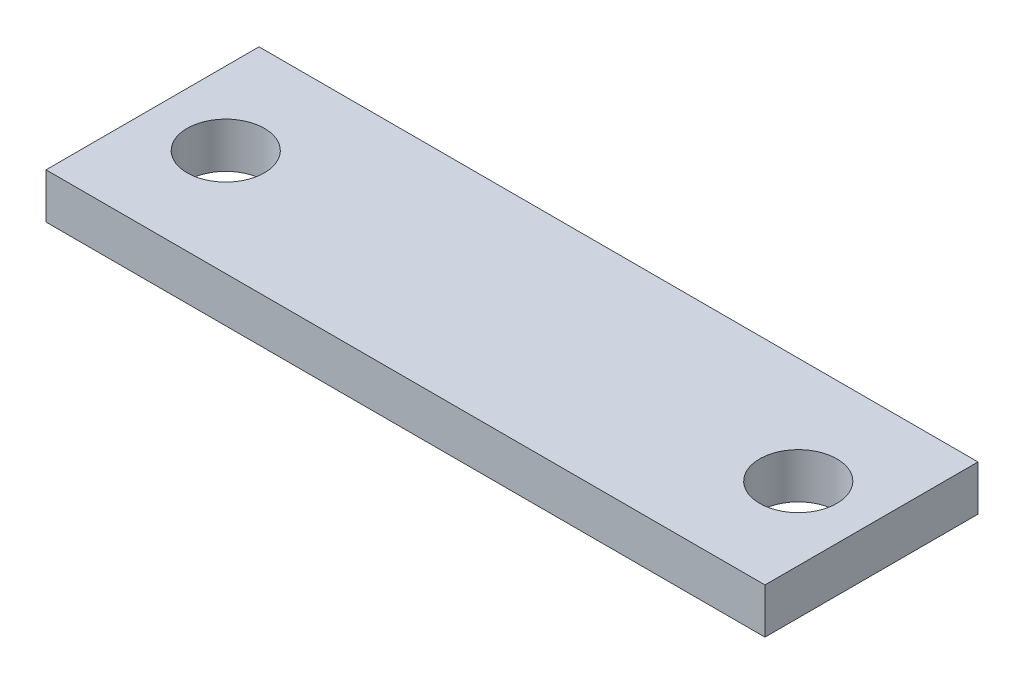
ISO-10303-21;
HEADER;
FILE_DESCRIPTION(('STEP AP214'),'2;1');
FILE_NAME('part.step','',(''),(''),'','','');
FILE_SCHEMA(('AUTOMOTIVE_DESIGN { 1 0 10303 214 1 1 1 1 }'));
ENDSEC;
DATA;
#1=APPLICATION_CONTEXT('core data for automotive mechanical design processes');
#2=APPLICATION_PROTOCOL_DEFINITION('international standard','automotive_design',2000,#1);
#3=PRODUCT_CONTEXT('',#1,'mechanical');
#4=PRODUCT('Part','Part','',(#3));
#5=PRODUCT_RELATED_PRODUCT_CATEGORY('part','',(#4));
#6=PRODUCT_DEFINITION_FORMATION('','',#4);
#7=PRODUCT_DEFINITION_CONTEXT('part definition',#1,'design');
#8=PRODUCT_DEFINITION('design','',#6,#7);
#9=PRODUCT_DEFINITION_SHAPE('','',#8);
#10=(LENGTH_UNIT() NAMED_UNIT(*) SI_UNIT(.MILLI.,.METRE.));
#11=(NAMED_UNIT(*) PLANE_ANGLE_UNIT() SI_UNIT($,.RADIAN.));
#12=(NAMED_UNIT(*) SI_UNIT($,.STERADIAN.) SOLID_ANGLE_UNIT());
#13=UNCERTAINTY_MEASURE_WITH_UNIT(LENGTH_MEASURE(1.E-05),#10,'distance_accuracy_value','');
#14=(GEOMETRIC_REPRESENTATION_CONTEXT(3) GLOBAL_UNCERTAINTY_ASSIGNED_CONTEXT((#13)) GLOBAL_UNIT_ASSIGNED_CONTEXT((#10,
#11,#12)) REPRESENTATION_CONTEXT('',''));
#15=CARTESIAN_POINT('',(0.,0.,0.));
#16=DIRECTION('',(0.,0.,1.));
#17=DIRECTION('',(1.,0.,0.));
#18=AXIS2_PLACEMENT_3D('',#15,#16,#17);
#19=CARTESIAN_POINT('',(0.,1.7,0.));
#20=DIRECTION('',(0.,1.,0.));
#21=DIRECTION('',(0.,0.,1.));
#22=AXIS2_PLACEMENT_3D('',#19,#20,#21);
#23=PLANE('',#22);
#24=CARTESIAN_POINT('',(-10.75,1.7,0.));
#25=DIRECTION('',(0.,1.,0.));
#26=DIRECTION('',(0.,0.,1.));
#27=AXIS2_PLACEMENT_3D('',#24,#25,#26);
#28=CIRCLE('',#27,1.45);
#29=CARTESIAN_POINT('',(-10.75,1.7,1.45));
#30=VERTEX_POINT('',#29);
#31=EDGE_CURVE('E100',#30,#30,#28,.T.);
#32=ORIENTED_EDGE('',*,*,#31,.F.);
#33=EDGE_LOOP('',(#32));
#34=FACE_BOUND('',#33,.T.);
#35=DIRECTION('',(0.,0.,1.));
#36=VECTOR('',#35,1.);
#37=CARTESIAN_POINT('',(-13.5,1.7,-4.));
#38=LINE('',#37,#36);
#39=CARTESIAN_POINT('',(-13.5,1.7,-4.));
#40=VERTEX_POINT('',#39);
#41=CARTESIAN_POINT('',(-13.5,1.7,4.));
#42=VERTEX_POINT('',#41);
#43=EDGE_CURVE('E85',#40,#42,#38,.T.);
#44=ORIENTED_EDGE('',*,*,#43,.T.);
#45=DIRECTION('',(1.,0.,0.));
#46=VECTOR('',#45,1.);
#47=CARTESIAN_POINT('',(-13.5,1.7,4.));
#48=LINE('',#47,#46);
#49=CARTESIAN_POINT('',(13.5,1.7,4.));
#50=VERTEX_POINT('',#49);
#51=EDGE_CURVE('E80',#42,#50,#48,.T.);
#52=ORIENTED_EDGE('',*,*,#51,.T.);
#53=DIRECTION('',(0.,0.,-1.));
#54=VECTOR('',#53,1.);
#55=CARTESIAN_POINT('',(13.5,1.7,-4.));
#56=LINE('',#55,#54);
#57=CARTESIAN_POINT('',(13.5,1.7,-4.));
#58=VERTEX_POINT('',#57);
#59=EDGE_CURVE('E83',#50,#58,#56,.T.);
#60=ORIENTED_EDGE('',*,*,#59,.T.);
#61=DIRECTION('',(-1.,0.,0.));
#62=VECTOR('',#61,1.);
#63=CARTESIAN_POINT('',(-13.5,1.7,-4.));
#64=LINE('',#63,#62);
#65=EDGE_CURVE('E50',#58,#40,#64,.T.);
#66=ORIENTED_EDGE('',*,*,#65,.T.);
#67=EDGE_LOOP('',(#44,#52,#60,#66));
#68=FACE_BOUND('',#67,.T.);
#69=CARTESIAN_POINT('',(10.75,1.7,0.));
#70=DIRECTION('',(0.,1.,0.));
#71=DIRECTION('',(0.,0.,1.));
#72=AXIS2_PLACEMENT_3D('',#69,#70,#71);
#73=CIRCLE('',#72,1.45);
#74=CARTESIAN_POINT('',(10.75,1.7,1.45));
#75=VERTEX_POINT('',#74);
#76=EDGE_CURVE('E115',#75,#75,#73,.T.);
#77=ORIENTED_EDGE('',*,*,#76,.F.);
#78=EDGE_LOOP('',(#77));
#79=FACE_BOUND('',#78,.T.);
#80=ADVANCED_FACE('F33',(#34,#68,#79),#23,.T.);
#81=CARTESIAN_POINT('',(0.,0.,0.));
#82=DIRECTION('',(0.,1.,0.));
#83=DIRECTION('',(0.,0.,1.));
#84=AXIS2_PLACEMENT_3D('',#81,#82,#83);
#85=PLANE('',#84);
#86=CARTESIAN_POINT('',(-10.75,0.,0.));
#87=DIRECTION('',(0.,1.,0.));
#88=DIRECTION('',(0.,0.,1.));
#89=AXIS2_PLACEMENT_3D('',#86,#87,#88);
#90=CIRCLE('',#89,1.45);
#91=CARTESIAN_POINT('',(-10.75,0.,1.45));
#92=VERTEX_POINT('',#91);
#93=EDGE_CURVE('E112',#92,#92,#90,.T.);
#94=ORIENTED_EDGE('',*,*,#93,.T.);
#95=EDGE_LOOP('',(#94));
#96=FACE_BOUND('',#95,.T.);
#97=DIRECTION('',(0.,0.,1.));
#98=VECTOR('',#97,1.);
#99=CARTESIAN_POINT('',(-13.5,0.,-4.));
#100=LINE('',#99,#98);
#101=CARTESIAN_POINT('',(-13.5,0.,-4.));
#102=VERTEX_POINT('',#101);
#103=CARTESIAN_POINT('',(-13.5,0.,4.));
#104=VERTEX_POINT('',#103);
#105=EDGE_CURVE('E97',#102,#104,#100,.T.);
#106=ORIENTED_EDGE('',*,*,#105,.F.);
#107=DIRECTION('',(-1.,0.,0.));
#108=VECTOR('',#107,1.);
#109=CARTESIAN_POINT('',(-13.5,0.,-4.));
#110=LINE('',#109,#108);
#111=CARTESIAN_POINT('',(13.5,0.,-4.));
#112=VERTEX_POINT('',#111);
#113=EDGE_CURVE('E73',#112,#102,#110,.T.);
#114=ORIENTED_EDGE('',*,*,#113,.F.);
#115=DIRECTION('',(0.,0.,-1.));
#116=VECTOR('',#115,1.);
#117=CARTESIAN_POINT('',(13.5,0.,-4.));
#118=LINE('',#117,#116);
#119=CARTESIAN_POINT('',(13.5,0.,4.));
#120=VERTEX_POINT('',#119);
#121=EDGE_CURVE('E67',#120,#112,#118,.T.);
#122=ORIENTED_EDGE('',*,*,#121,.F.);
#123=DIRECTION('',(1.,0.,0.));
#124=VECTOR('',#123,1.);
#125=CARTESIAN_POINT('',(-13.5,0.,4.));
#126=LINE('',#125,#124);
#127=EDGE_CURVE('E89',#104,#120,#126,.T.);
#128=ORIENTED_EDGE('',*,*,#127,.F.);
#129=EDGE_LOOP('',(#106,#114,#122,#128));
#130=FACE_BOUND('',#129,.T.);
#131=CARTESIAN_POINT('',(10.75,0.,0.));
#132=DIRECTION('',(0.,1.,0.));
#133=DIRECTION('',(0.,0.,1.));
#134=AXIS2_PLACEMENT_3D('',#131,#132,#133);
#135=CIRCLE('',#134,1.45);
#136=CARTESIAN_POINT('',(10.75,0.,1.45));
#137=VERTEX_POINT('',#136);
#138=EDGE_CURVE('E118',#137,#137,#135,.T.);
#139=ORIENTED_EDGE('',*,*,#138,.T.);
#140=EDGE_LOOP('',(#139));
#141=FACE_BOUND('',#140,.T.);
#142=ADVANCED_FACE('F108',(#96,#130,#141),#85,.F.);
#143=CARTESIAN_POINT('',(-13.5,1.7,-4.));
#144=DIRECTION('',(1.,0.,0.));
#145=DIRECTION('',(0.,0.,-1.));
#146=AXIS2_PLACEMENT_3D('',#143,#144,#145);
#147=PLANE('',#146);
#148=ORIENTED_EDGE('',*,*,#105,.T.);
#149=DIRECTION('',(0.,-1.,0.));
#150=VECTOR('',#149,1.);
#151=CARTESIAN_POINT('',(-13.5,1.7,4.));
#152=LINE('',#151,#150);
#153=EDGE_CURVE('E11',#42,#104,#152,.T.);
#154=ORIENTED_EDGE('',*,*,#153,.F.);
#155=ORIENTED_EDGE('',*,*,#43,.F.);
#156=DIRECTION('',(0.,-1.,0.));
#157=VECTOR('',#156,1.);
#158=CARTESIAN_POINT('',(-13.5,1.7,-4.));
#159=LINE('',#158,#157);
#160=EDGE_CURVE('E93',#40,#102,#159,.T.);
#161=ORIENTED_EDGE('',*,*,#160,.T.);
#162=EDGE_LOOP('',(#148,#154,#155,#161));
#163=FACE_BOUND('',#162,.T.);
#164=ADVANCED_FACE('F35',(#163),#147,.F.);
#165=CARTESIAN_POINT('',(-13.5,1.7,4.));
#166=DIRECTION('',(0.,0.,-1.));
#167=DIRECTION('',(-1.,0.,0.));
#168=AXIS2_PLACEMENT_3D('',#165,#166,#167);
#169=PLANE('',#168);
#170=ORIENTED_EDGE('',*,*,#127,.T.);
#171=DIRECTION('',(0.,-1.,0.));
#172=VECTOR('',#171,1.);
#173=CARTESIAN_POINT('',(13.5,1.7,4.));
#174=LINE('',#173,#172);
#175=EDGE_CURVE('E42',#50,#120,#174,.T.);
#176=ORIENTED_EDGE('',*,*,#175,.F.);
#177=ORIENTED_EDGE('',*,*,#51,.F.);
#178=ORIENTED_EDGE('',*,*,#153,.T.);
#179=EDGE_LOOP('',(#170,#176,#177,#178));
#180=FACE_BOUND('',#179,.T.);
#181=ADVANCED_FACE('F88',(#180),#169,.F.);
#182=CARTESIAN_POINT('',(13.5,1.7,-4.));
#183=DIRECTION('',(-1.,0.,0.));
#184=DIRECTION('',(0.,0.,1.));
#185=AXIS2_PLACEMENT_3D('',#182,#183,#184);
#186=PLANE('',#185);
#187=ORIENTED_EDGE('',*,*,#121,.T.);
#188=DIRECTION('',(0.,-1.,0.));
#189=VECTOR('',#188,1.);
#190=CARTESIAN_POINT('',(13.5,1.7,-4.));
#191=LINE('',#190,#189);
#192=EDGE_CURVE('E90',#58,#112,#191,.T.);
#193=ORIENTED_EDGE('',*,*,#192,.F.);
#194=ORIENTED_EDGE('',*,*,#59,.F.);
#195=ORIENTED_EDGE('',*,*,#175,.T.);
#196=EDGE_LOOP('',(#187,#193,#194,#195));
#197=FACE_BOUND('',#196,.T.);
#198=ADVANCED_FACE('F91',(#197),#186,.F.);
#199=CARTESIAN_POINT('',(-13.5,1.7,-4.));
#200=DIRECTION('',(0.,0.,1.));
#201=DIRECTION('',(1.,0.,0.));
#202=AXIS2_PLACEMENT_3D('',#199,#200,#201);
#203=PLANE('',#202);
#204=ORIENTED_EDGE('',*,*,#113,.T.);
#205=ORIENTED_EDGE('',*,*,#160,.F.);
#206=ORIENTED_EDGE('',*,*,#65,.F.);
#207=ORIENTED_EDGE('',*,*,#192,.T.);
#208=EDGE_LOOP('',(#204,#205,#206,#207));
#209=FACE_BOUND('',#208,.T.);
#210=ADVANCED_FACE('F105',(#209),#203,.F.);
#211=CARTESIAN_POINT('',(-10.75,1.7,0.));
#212=DIRECTION('',(0.,-1.,0.));
#213=DIRECTION('',(0.,0.,-1.));
#214=AXIS2_PLACEMENT_3D('',#211,#212,#213);
#215=CYLINDRICAL_SURFACE('',#214,1.45);
#216=ORIENTED_EDGE('',*,*,#31,.T.);
#217=EDGE_LOOP('',(#216));
#218=FACE_BOUND('',#217,.T.);
#219=ORIENTED_EDGE('',*,*,#93,.F.);
#220=EDGE_LOOP('',(#219));
#221=FACE_BOUND('',#220,.T.);
#222=ADVANCED_FACE('F136',(#218,#221),#215,.F.);
#223=CARTESIAN_POINT('',(10.75,1.7,0.));
#224=DIRECTION('',(0.,-1.,0.));
#225=DIRECTION('',(0.,0.,-1.));
#226=AXIS2_PLACEMENT_3D('',#223,#224,#225);
#227=CYLINDRICAL_SURFACE('',#226,1.45);
#228=ORIENTED_EDGE('',*,*,#76,.T.);
#229=EDGE_LOOP('',(#228));
#230=FACE_BOUND('',#229,.T.);
#231=ORIENTED_EDGE('',*,*,#138,.F.);
#232=EDGE_LOOP('',(#231));
#233=FACE_BOUND('',#232,.T.);
#234=ADVANCED_FACE('F124',(#230,#233),#227,.F.);
#235=CLOSED_SHELL('',(#80,#142,#164,#181,#198,#210,#222,#234));
#236=MANIFOLD_SOLID_BREP('B2',#235);
#237=ADVANCED_BREP_SHAPE_REPRESENTATION('',(#18,#236),#14);
#238=SHAPE_DEFINITION_REPRESENTATION(#9,#237);
ENDSEC;
END-ISO-10303-21;
